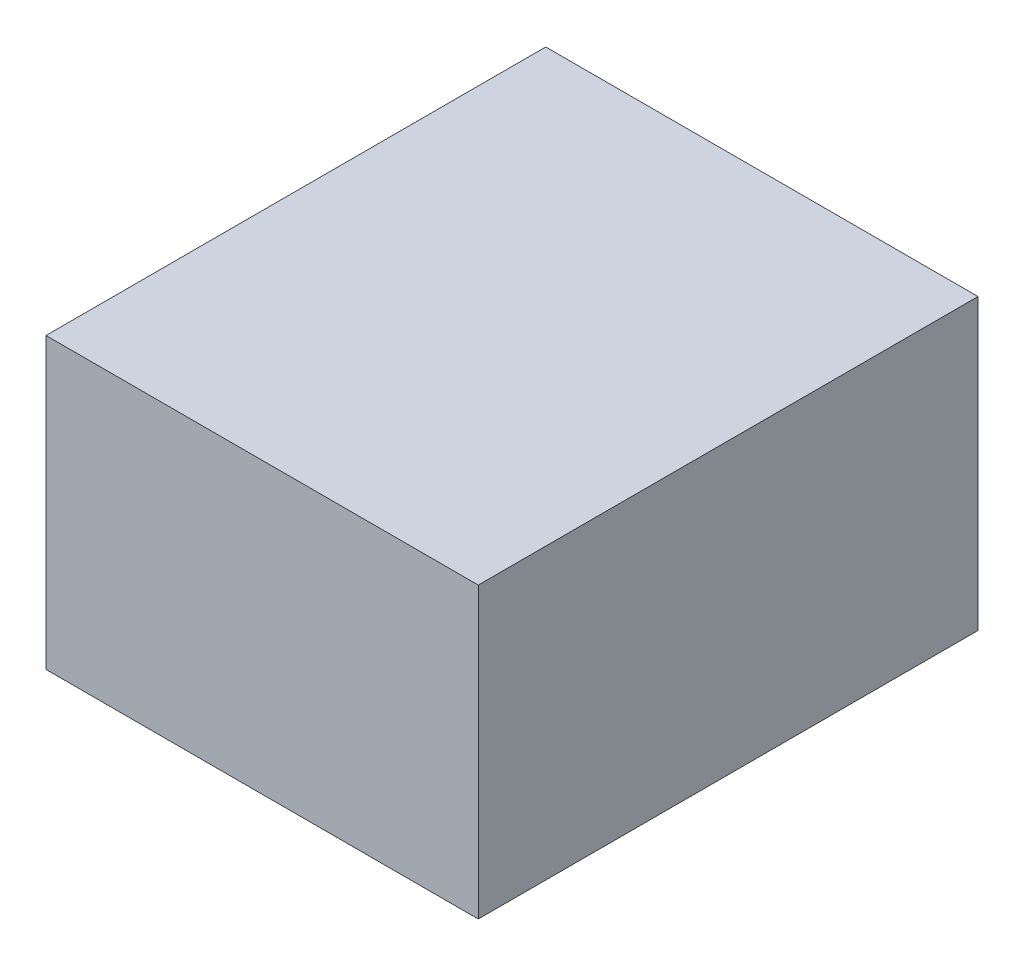
ISO-10303-21;
HEADER;
FILE_DESCRIPTION(('STEP AP214'),'2;1');
FILE_NAME('part.step','',(''),(''),'','','');
FILE_SCHEMA(('AUTOMOTIVE_DESIGN { 1 0 10303 214 1 1 1 1 }'));
ENDSEC;
DATA;
#1=APPLICATION_CONTEXT('core data for automotive mechanical design processes');
#2=APPLICATION_PROTOCOL_DEFINITION('international standard','automotive_design',2000,#1);
#3=PRODUCT_CONTEXT('',#1,'mechanical');
#4=PRODUCT('Part','Part','',(#3));
#5=PRODUCT_RELATED_PRODUCT_CATEGORY('part','',(#4));
#6=PRODUCT_DEFINITION_FORMATION('','',#4);
#7=PRODUCT_DEFINITION_CONTEXT('part definition',#1,'design');
#8=PRODUCT_DEFINITION('design','',#6,#7);
#9=PRODUCT_DEFINITION_SHAPE('','',#8);
#10=(LENGTH_UNIT() NAMED_UNIT(*) SI_UNIT(.MILLI.,.METRE.));
#11=(NAMED_UNIT(*) PLANE_ANGLE_UNIT() SI_UNIT($,.RADIAN.));
#12=(NAMED_UNIT(*) SI_UNIT($,.STERADIAN.) SOLID_ANGLE_UNIT());
#13=UNCERTAINTY_MEASURE_WITH_UNIT(LENGTH_MEASURE(1.E-05),#10,'distance_accuracy_value','');
#14=(GEOMETRIC_REPRESENTATION_CONTEXT(3) GLOBAL_UNCERTAINTY_ASSIGNED_CONTEXT((#13)) GLOBAL_UNIT_ASSIGNED_CONTEXT((#10,
#11,#12)) REPRESENTATION_CONTEXT('',''));
#15=CARTESIAN_POINT('',(0.,0.,0.));
#16=DIRECTION('',(0.,0.,1.));
#17=DIRECTION('',(1.,0.,0.));
#18=AXIS2_PLACEMENT_3D('',#15,#16,#17);
#19=CARTESIAN_POINT('',(0.,0.,101.6));
#20=CARTESIAN_POINT('',(-0.161456166213855,-8.80682857893025,90.3900110978467));
#21=CARTESIAN_POINT('',(-24.5375363297914,47.4863543889421,82.5227913092164));
#22=CARTESIAN_POINT('',(-9.21380364995567,0.0610764653543384,44.1387854031464));
#23=CARTESIAN_POINT('',(18.7958772758672,14.026660670037,31.12334443118));
#24=CARTESIAN_POINT('',(36.9374847479725,20.4231066463661,25.4));
#25=CARTESIAN_POINT('',(0.,0.,101.6));
#26=CARTESIAN_POINT('',(-2.70965146499869,-7.33544956058059,90.3981227477073));
#27=CARTESIAN_POINT('',(-6.43754095514007,44.9919741604561,82.520875414313));
#28=CARTESIAN_POINT('',(-8.55238277983755,7.81973446501629,44.1373151611525));
#29=CARTESIAN_POINT('',(19.853323250958,6.52086740262849,31.1314560810406));
#30=CARTESIAN_POINT('',(36.9374847479725,6.80770221545535,25.4));
#31=CARTESIAN_POINT('',(0.,0.,101.6));
#32=CARTESIAN_POINT('',(-5.25784676378353,-5.86407054223094,90.4062343975679));
#33=CARTESIAN_POINT('',(10.9262983284026,44.1888945435245,82.5189595194096));
#34=CARTESIAN_POINT('',(-5.64701474105575,10.4229787358583,44.1358449191586));
#35=CARTESIAN_POINT('',(20.9107692260488,-0.984925864780037,31.1395677309013));
#36=CARTESIAN_POINT('',(36.9374847479725,-6.80770221545535,25.4));
#37=CARTESIAN_POINT('',(0.,0.,101.6));
#38=CARTESIAN_POINT('',(-7.80604206256838,-4.39269152388128,90.4143460474285));
#39=CARTESIAN_POINT('',(28.931646273169,45.1152339581451,82.5170436245062));
#40=CARTESIAN_POINT('',(-4.69709006736013,7.75461690827075,44.1343746771647));
#41=CARTESIAN_POINT('',(21.9682152011396,-8.49071913218856,31.1476793807619));
#42=CARTESIAN_POINT('',(36.9374847479725,-20.4231066463661,25.4));
#43=B_SPLINE_SURFACE_WITH_KNOTS('',3,3,((#19,#20,#21,#22,#23,#24),(#25,#26,#27,#28,#29,#30),
(#31,#32,#33,#34,#35,#36),(#37,#38,#39,#40,#41,#42)),.UNSPECIFIED.,.F.,.F.,.F.,(4,4),(4,1,1,4),
(0.,1.),(0.,0.352431840203021,0.614756103061783,1.),.UNSPECIFIED.);
#44=CARTESIAN_POINT('',(0.,0.,101.6));
#45=CARTESIAN_POINT('',(-7.80604206256838,-4.39269152388128,90.4143460474285));
#46=CARTESIAN_POINT('',(28.931646273169,45.1152339581451,82.5170436245062));
#47=CARTESIAN_POINT('',(-4.69709006736013,7.75461690827075,44.1343746771647));
#48=CARTESIAN_POINT('',(21.9682152011396,-8.49071913218856,31.1476793807619));
#49=CARTESIAN_POINT('',(36.9374847479725,-20.4231066463661,25.4));
#50=B_SPLINE_CURVE_WITH_KNOTS('',3,(#44,#45,#46,#47,#48,#49),.UNSPECIFIED.,.F.,.F.,(4,1,1,4),
(0.,0.352431840203021,0.614756103061783,1.),.UNSPECIFIED.);
#51=CARTESIAN_POINT('',(0.,0.,101.6));
#52=VERTEX_POINT('',#51);
#53=CARTESIAN_POINT('',(36.9374847479725,-20.4231066463661,25.4));
#54=VERTEX_POINT('',#53);
#55=EDGE_CURVE('E243',#52,#54,#50,.T.);
#56=CARTESIAN_POINT('',(0.,0.,101.6));
#57=CARTESIAN_POINT('',(-0.161456166213855,-8.80682857893025,90.3900110978467));
#58=CARTESIAN_POINT('',(-24.5375363297914,47.4863543889421,82.5227913092164));
#59=CARTESIAN_POINT('',(-9.21380364995567,0.0610764653543384,44.1387854031464));
#60=CARTESIAN_POINT('',(18.7958772758672,14.026660670037,31.12334443118));
#61=CARTESIAN_POINT('',(36.9374847479725,20.4231066463661,25.4));
#62=B_SPLINE_CURVE_WITH_KNOTS('',3,(#56,#57,#58,#59,#60,#61),.UNSPECIFIED.,.F.,.F.,(4,1,1,4),
(0.,0.352431840203021,0.614756103061783,1.),.UNSPECIFIED.);
#63=CARTESIAN_POINT('',(36.9374847479725,20.4231066463661,25.4));
#64=VERTEX_POINT('',#63);
#65=EDGE_CURVE('E239',#64,#52,#62,.F.);
#66=DIRECTION('',(0.,1.,0.));
#67=VECTOR('',#66,1.);
#68=CARTESIAN_POINT('',(36.9374847479725,20.4231066463661,25.4));
#69=LINE('',#68,#67);
#70=EDGE_CURVE('E208',#54,#64,#69,.T.);
#71=ORIENTED_EDGE('',*,*,#55,.F.);
#72=ORIENTED_EDGE('',*,*,#65,.F.);
#73=ORIENTED_EDGE('',*,*,#70,.F.);
#74=EDGE_LOOP('',(#71,#72,#73));
#75=FACE_BOUND('',#74,.T.);
#76=ADVANCED_FACE('F60',(#75),#43,.F.);
#77=CARTESIAN_POINT('',(0.,0.,101.6));
#78=CARTESIAN_POINT('',(-7.80604206256837,-4.39269152388128,90.4143460474286));
#79=CARTESIAN_POINT('',(28.931646273169,45.1152339581451,82.5170436245062));
#80=CARTESIAN_POINT('',(-4.69709006736013,7.75461690827075,44.1343746771647));
#81=CARTESIAN_POINT('',(21.9682152011396,-8.49071913218856,31.1476793807619));
#82=CARTESIAN_POINT('',(36.9374847479725,-20.4231066463661,25.4));
#83=CARTESIAN_POINT('',(0.,0.,101.6));
#84=CARTESIAN_POINT('',(-7.33597684576478,-1.96065700709015,91.0524749707828));
#85=CARTESIAN_POINT('',(35.6752656867836,28.7732225050233,82.3663236140291));
#86=CARTESIAN_POINT('',(2.37491880085313,9.75249744423343,44.018713380539));
#87=CARTESIAN_POINT('',(16.1191692705829,-9.13137955474962,31.7858083041161));
#88=CARTESIAN_POINT('',(24.6249898319817,-20.4231066463661,25.4));
#89=CARTESIAN_POINT('',(0.,0.,101.6));
#90=CARTESIAN_POINT('',(-6.86591162896119,0.471377509700983,91.690603894137));
#91=CARTESIAN_POINT('',(43.515516349886,13.9143912337294,82.215603603552));
#92=CARTESIAN_POINT('',(6.10418199722109,7.22935586297321,43.9030520839134));
#93=CARTESIAN_POINT('',(10.2701233400261,-9.77203997731067,32.4239372274703));
#94=CARTESIAN_POINT('',(12.3124949159908,-20.4231066463661,25.4));
#95=CARTESIAN_POINT('',(0.,0.,101.6));
#96=CARTESIAN_POINT('',(-6.39584641215759,2.90341202649212,92.3287328174912));
#97=CARTESIAN_POINT('',(53.1742421587129,-0.63529331915581,82.064883593075));
#98=CARTESIAN_POINT('',(4.29037871106099,3.76387486232459,43.7873907872877));
#99=CARTESIAN_POINT('',(4.42107740946935,-10.4127003998717,33.0620661508246));
#100=CARTESIAN_POINT('',(0.,-20.4231066463661,25.4));
#101=B_SPLINE_SURFACE_WITH_KNOTS('',3,3,((#77,#78,#79,#80,#81,#82),(#83,#84,#85,#86,#87,#88),
(#89,#90,#91,#92,#93,#94),(#95,#96,#97,#98,#99,#100)),.UNSPECIFIED.,.F.,.F.,.F.,(4,4),(4,1,1,4),
(0.,1.),(0.,0.352431840203021,0.614756103061783,1.),.UNSPECIFIED.);
#102=CARTESIAN_POINT('',(0.,0.,101.6));
#103=CARTESIAN_POINT('',(-6.39584641215759,2.90341202649212,92.3287328174912));
#104=CARTESIAN_POINT('',(53.1742421587129,-0.63529331915581,82.064883593075));
#105=CARTESIAN_POINT('',(4.29037871106099,3.76387486232459,43.7873907872877));
#106=CARTESIAN_POINT('',(4.42107740946935,-10.4127003998717,33.0620661508246));
#107=CARTESIAN_POINT('',(0.,-20.4231066463661,25.4));
#108=B_SPLINE_CURVE_WITH_KNOTS('',3,(#102,#103,#104,#105,#106,#107),.UNSPECIFIED.,.F.,.F.,(4,1,
1,4),(0.,0.352431840203021,0.614756103061783,1.),.UNSPECIFIED.);
#109=CARTESIAN_POINT('',(0.,-20.4231066463661,25.4));
#110=VERTEX_POINT('',#109);
#111=EDGE_CURVE('E234',#52,#110,#108,.T.);
#112=DIRECTION('',(1.,0.,0.));
#113=VECTOR('',#112,1.);
#114=CARTESIAN_POINT('',(-36.9374847479725,-20.4231066463661,25.4));
#115=LINE('',#114,#113);
#116=EDGE_CURVE('E167',#110,#54,#115,.T.);
#117=ORIENTED_EDGE('',*,*,#111,.F.);
#118=ORIENTED_EDGE('',*,*,#55,.T.);
#119=ORIENTED_EDGE('',*,*,#116,.F.);
#120=EDGE_LOOP('',(#117,#118,#119));
#121=FACE_BOUND('',#120,.T.);
#122=ADVANCED_FACE('F242',(#121),#101,.F.);
#123=CARTESIAN_POINT('',(0.,0.,101.6));
#124=CARTESIAN_POINT('',(11.8896312646873,-2.53548717088972,91.4521042416582));
#125=CARTESIAN_POINT('',(-56.9659134477832,0.548392951437509,82.2719349635716));
#126=CARTESIAN_POINT('',(2.31634527119978,-3.83056148990464,43.9462803063632));
#127=CARTESIAN_POINT('',(-23.5522823889213,10.7806252554741,32.1854375749916));
#128=CARTESIAN_POINT('',(-36.9374847479725,20.4231066463661,25.4));
#129=CARTESIAN_POINT('',(0.,0.,101.6));
#130=CARTESIAN_POINT('',(7.87260212105361,-4.62593430690323,91.098073193721));
#131=CARTESIAN_POINT('',(-44.542274019888,15.5822090397403,82.3555537454532));
#132=CARTESIAN_POINT('',(-6.44737396867199,-0.667332204073219,44.0104486719576));
#133=CARTESIAN_POINT('',(-9.43622916732512,11.8626370603284,31.8314065270544));
#134=CARTESIAN_POINT('',(-12.3124949159908,20.4231066463661,25.4));
#135=CARTESIAN_POINT('',(0.,0.,101.6));
#136=CARTESIAN_POINT('',(3.85557297741988,-6.71638144291674,90.7440421457839));
#137=CARTESIAN_POINT('',(-33.9514219325894,30.8241455577693,82.4391725273348));
#138=CARTESIAN_POINT('',(-9.62440036803476,1.86150547016113,44.074617037552));
#139=CARTESIAN_POINT('',(4.67982405427105,12.9446488651827,31.4773754791172));
#140=CARTESIAN_POINT('',(12.3124949159908,20.4231066463661,25.4));
#141=CARTESIAN_POINT('',(0.,0.,101.6));
#142=CARTESIAN_POINT('',(-0.161456166213854,-8.80682857893025,90.3900110978467));
#143=CARTESIAN_POINT('',(-24.5375363297914,47.4863543889421,82.5227913092164));
#144=CARTESIAN_POINT('',(-9.21380364995567,0.0610764653543351,44.1387854031464));
#145=CARTESIAN_POINT('',(18.7958772758672,14.026660670037,31.12334443118));
#146=CARTESIAN_POINT('',(36.9374847479725,20.4231066463661,25.4));
#147=B_SPLINE_SURFACE_WITH_KNOTS('',3,3,((#123,#124,#125,#126,#127,#128),(#129,#130,#131,#132,
#133,#134),(#135,#136,#137,#138,#139,#140),(#141,#142,#143,#144,#145,#146)),.UNSPECIFIED.,.F.,
.F.,.F.,(4,4),(4,1,1,4),(0.,1.),(0.,0.352431840203021,0.614756103061783,1.),.UNSPECIFIED.);
#148=CARTESIAN_POINT('',(0.,0.,101.6));
#149=CARTESIAN_POINT('',(11.8896312646873,-2.53548717088971,91.4521042416582));
#150=CARTESIAN_POINT('',(-56.9659134477831,0.548392951437499,82.2719349635716));
#151=CARTESIAN_POINT('',(2.31634527119978,-3.83056148990463,43.9462803063633));
#152=CARTESIAN_POINT('',(-23.5522823889213,10.7806252554741,32.1854375749916));
#153=CARTESIAN_POINT('',(-36.9374847479725,20.4231066463661,25.4));
#154=B_SPLINE_CURVE_WITH_KNOTS('',3,(#148,#149,#150,#151,#152,#153),.UNSPECIFIED.,.F.,.F.,(4,1,
1,4),(0.,0.352431840203021,0.614756103061783,1.),.UNSPECIFIED.);
#155=CARTESIAN_POINT('',(-36.9374847479725,20.4231066463661,25.4));
#156=VERTEX_POINT('',#155);
#157=EDGE_CURVE('E187',#52,#156,#154,.T.);
#158=DIRECTION('',(-1.,0.,0.));
#159=VECTOR('',#158,1.);
#160=CARTESIAN_POINT('',(-36.9374847479725,20.4231066463661,25.4));
#161=LINE('',#160,#159);
#162=EDGE_CURVE('E181',#64,#156,#161,.T.);
#163=ORIENTED_EDGE('',*,*,#65,.T.);
#164=ORIENTED_EDGE('',*,*,#157,.T.);
#165=ORIENTED_EDGE('',*,*,#162,.F.);
#166=EDGE_LOOP('',(#163,#164,#165));
#167=FACE_BOUND('',#166,.T.);
#168=ADVANCED_FACE('F266',(#167),#147,.F.);
#169=CARTESIAN_POINT('',(0.,0.,101.6));
#170=CARTESIAN_POINT('',(-6.39584641215759,2.90341202649211,92.3287328174913));
#171=CARTESIAN_POINT('',(53.1742421587129,-0.635293319155802,82.064883593075));
#172=CARTESIAN_POINT('',(4.29037871106099,3.76387486232457,43.7873907872877));
#173=CARTESIAN_POINT('',(4.42107740946935,-10.4127003998717,33.0620661508246));
#174=CARTESIAN_POINT('',(0.,-20.4231066463661,25.4));
#175=CARTESIAN_POINT('',(0.,0.,101.6));
#176=CARTESIAN_POINT('',(-4.21007888603378,4.87121754397149,91.6824922442764));
#177=CARTESIAN_POINT('',(42.0144931605079,-15.6401426182191,82.2175194984555));
#178=CARTESIAN_POINT('',(10.8518566235125,0.622874452353174,43.9045223259073));
#179=CARTESIAN_POINT('',(-3.31790748564284,-11.6173538232602,32.4158255776097));
#180=CARTESIAN_POINT('',(-12.3124949159909,-20.4231066463661,25.4));
#181=CARTESIAN_POINT('',(0.,0.,101.6));
#182=CARTESIAN_POINT('',(-2.02431135990997,6.83902306145087,91.0362516710615));
#183=CARTESIAN_POINT('',(32.6875315028993,-30.8531123470088,82.3701554038359));
#184=CARTESIAN_POINT('',(11.826641695455,-1.88373434602116,44.0216538645269));
#185=CARTESIAN_POINT('',(-11.056892380755,-12.8220072466486,31.7695850043949));
#186=CARTESIAN_POINT('',(-24.6249898319817,-20.4231066463661,25.4));
#187=CARTESIAN_POINT('',(0.,0.,101.6));
#188=CARTESIAN_POINT('',(0.161456166213842,8.80682857893025,90.3900110978467));
#189=CARTESIAN_POINT('',(24.5375363297915,-47.4863543889421,82.5227913092164));
#190=CARTESIAN_POINT('',(9.21380364995565,-0.0610764653543416,44.1387854031464));
#191=CARTESIAN_POINT('',(-18.7958772758672,-14.026660670037,31.12334443118));
#192=CARTESIAN_POINT('',(-36.9374847479725,-20.4231066463661,25.4));
#193=B_SPLINE_SURFACE_WITH_KNOTS('',3,3,((#169,#170,#171,#172,#173,#174),(#175,#176,#177,#178,
#179,#180),(#181,#182,#183,#184,#185,#186),(#187,#188,#189,#190,#191,#192)),.UNSPECIFIED.,.F.,
.F.,.F.,(4,4),(4,1,1,4),(0.,1.),(0.,0.352431840203021,0.614756103061783,1.),.UNSPECIFIED.);
#194=CARTESIAN_POINT('',(0.,0.,101.6));
#195=CARTESIAN_POINT('',(0.161456166213842,8.80682857893025,90.3900110978467));
#196=CARTESIAN_POINT('',(24.5375363297915,-47.4863543889421,82.5227913092164));
#197=CARTESIAN_POINT('',(9.21380364995565,-0.0610764653543416,44.1387854031464));
#198=CARTESIAN_POINT('',(-18.7958772758672,-14.026660670037,31.12334443118));
#199=CARTESIAN_POINT('',(-36.9374847479725,-20.4231066463661,25.4));
#200=B_SPLINE_CURVE_WITH_KNOTS('',3,(#194,#195,#196,#197,#198,#199),.UNSPECIFIED.,.F.,.F.,(4,1,
1,4),(0.,0.352431840203021,0.614756103061783,1.),.UNSPECIFIED.);
#201=CARTESIAN_POINT('',(-36.9374847479725,-20.4231066463661,25.4));
#202=VERTEX_POINT('',#201);
#203=EDGE_CURVE('E236',#52,#202,#200,.T.);
#204=EDGE_CURVE('E64',#202,#110,#115,.T.);
#205=ORIENTED_EDGE('',*,*,#203,.F.);
#206=ORIENTED_EDGE('',*,*,#111,.T.);
#207=ORIENTED_EDGE('',*,*,#204,.F.);
#208=EDGE_LOOP('',(#205,#206,#207));
#209=FACE_BOUND('',#208,.T.);
#210=ADVANCED_FACE('F235',(#209),#193,.F.);
#211=CARTESIAN_POINT('',(0.,0.,101.6));
#212=CARTESIAN_POINT('',(0.161456166213841,8.80682857893025,90.3900110978467));
#213=CARTESIAN_POINT('',(24.5375363297915,-47.4863543889421,82.5227913092164));
#214=CARTESIAN_POINT('',(9.21380364995565,-0.0610764653543408,44.1387854031464));
#215=CARTESIAN_POINT('',(-18.7958772758672,-14.026660670037,31.12334443118));
#216=CARTESIAN_POINT('',(-36.9374847479725,-20.4231066463661,25.4));
#217=CARTESIAN_POINT('',(0.,0.,101.6));
#218=CARTESIAN_POINT('',(2.85393975913663,7.91398769187971,90.7392094695939));
#219=CARTESIAN_POINT('',(6.40346142605392,-45.5882887773523,82.4403139596996));
#220=CARTESIAN_POINT('',(8.52623042946266,-6.52343305440252,44.0754929633624));
#221=CARTESIAN_POINT('',(-19.7090349568201,-10.4807974149663,31.4725428029273));
#222=CARTESIAN_POINT('',(-36.9374847479725,-13.6154044309107,25.4));
#223=CARTESIAN_POINT('',(0.,0.,101.6));
#224=CARTESIAN_POINT('',(5.54642335205943,7.02114680482917,91.0884078413412));
#225=CARTESIAN_POINT('',(-10.9944573865749,-45.3815237773168,82.3578366101827));
#226=CARTESIAN_POINT('',(5.59471004030598,-7.83037591463072,44.0122005235784));
#227=CARTESIAN_POINT('',(-20.6221926377729,-6.93493415989553,31.8217411746745));
#228=CARTESIAN_POINT('',(-36.9374847479725,-6.80770221545535,25.4));
#229=CARTESIAN_POINT('',(0.,0.,101.6));
#230=CARTESIAN_POINT('',(8.23890694498222,6.12830591777863,91.4376062130884));
#231=CARTESIAN_POINT('',(-29.0338848604276,-46.9041778088335,82.2753592606658));
#232=CARTESIAN_POINT('',(4.6186330162355,-3.86571267642938,43.9489080837943));
#233=CARTESIAN_POINT('',(-21.5353503187258,-3.38907090482479,32.1709395464218));
#234=CARTESIAN_POINT('',(-36.9374847479725,0.,25.4));
#235=B_SPLINE_SURFACE_WITH_KNOTS('',3,3,((#211,#212,#213,#214,#215,#216),(#217,#218,#219,#220,
#221,#222),(#223,#224,#225,#226,#227,#228),(#229,#230,#231,#232,#233,#234)),.UNSPECIFIED.,.F.,
.F.,.F.,(4,4),(4,1,1,4),(0.,1.),(0.,0.352431840203021,0.614756103061783,1.),.UNSPECIFIED.);
#236=CARTESIAN_POINT('',(0.,0.,101.6));
#237=CARTESIAN_POINT('',(8.23890694498222,6.12830591777863,91.4376062130884));
#238=CARTESIAN_POINT('',(-29.0338848604276,-46.9041778088335,82.2753592606658));
#239=CARTESIAN_POINT('',(4.6186330162355,-3.86571267642938,43.9489080837943));
#240=CARTESIAN_POINT('',(-21.5353503187258,-3.38907090482479,32.1709395464218));
#241=CARTESIAN_POINT('',(-36.9374847479725,0.,25.4));
#242=B_SPLINE_CURVE_WITH_KNOTS('',3,(#236,#237,#238,#239,#240,#241),.UNSPECIFIED.,.F.,.F.,(4,1,
1,4),(0.,0.352431840203021,0.614756103061783,1.),.UNSPECIFIED.);
#243=CARTESIAN_POINT('',(-36.9374847479725,0.,25.4));
#244=VERTEX_POINT('',#243);
#245=EDGE_CURVE('E310',#52,#244,#242,.T.);
#246=DIRECTION('',(0.,-1.,0.));
#247=VECTOR('',#246,1.);
#248=CARTESIAN_POINT('',(-36.9374847479725,20.4231066463661,25.4));
#249=LINE('',#248,#247);
#250=EDGE_CURVE('E220',#244,#202,#249,.T.);
#251=ORIENTED_EDGE('',*,*,#245,.F.);
#252=ORIENTED_EDGE('',*,*,#203,.T.);
#253=ORIENTED_EDGE('',*,*,#250,.F.);
#254=EDGE_LOOP('',(#251,#252,#253));
#255=FACE_BOUND('',#254,.T.);
#256=ADVANCED_FACE('F379',(#255),#235,.F.);
#257=CARTESIAN_POINT('',(0.,0.,101.6));
#258=CARTESIAN_POINT('',(8.23890694498222,6.12830591777863,91.4376062130884));
#259=CARTESIAN_POINT('',(-29.0338848604276,-46.9041778088335,82.2753592606658));
#260=CARTESIAN_POINT('',(4.6186330162355,-3.86571267642938,43.9489080837943));
#261=CARTESIAN_POINT('',(-21.5353503187258,-3.38907090482479,32.1709395464218));
#262=CARTESIAN_POINT('',(-36.9374847479725,0.,25.4));
#263=CARTESIAN_POINT('',(0.,0.,101.6));
#264=CARTESIAN_POINT('',(9.4558150515506,3.24037488822251,91.4424388892784));
#265=CARTESIAN_POINT('',(-37.0073151746461,-29.994818528055,82.274217828301));
#266=CARTESIAN_POINT('',(-0.224982174182627,-7.18212349886586,43.948032157984));
#267=CARTESIAN_POINT('',(-22.207661008791,1.33416114860818,32.1757722226117));
#268=CARTESIAN_POINT('',(-36.9374847479725,6.80770221545535,25.4));
#269=CARTESIAN_POINT('',(0.,0.,101.6));
#270=CARTESIAN_POINT('',(10.672723158119,0.3524438586664,91.4472715654683));
#271=CARTESIAN_POINT('',(-46.0773767383524,-14.5686394291045,82.2730763959363));
#272=CARTESIAN_POINT('',(-1.72585169275545,-5.97751220407944,43.9471562321736));
#273=CARTESIAN_POINT('',(-22.8799716988561,6.05739320204115,32.1806048988016));
#274=CARTESIAN_POINT('',(-36.9374847479725,13.6154044309107,25.4));
#275=CARTESIAN_POINT('',(0.,0.,101.6));
#276=CARTESIAN_POINT('',(11.8896312646873,-2.53548717088971,91.4521042416582));
#277=CARTESIAN_POINT('',(-56.9659134477831,0.548392951437499,82.2719349635716));
#278=CARTESIAN_POINT('',(2.31634527119978,-3.83056148990463,43.9462803063633));
#279=CARTESIAN_POINT('',(-23.5522823889213,10.7806252554741,32.1854375749916));
#280=CARTESIAN_POINT('',(-36.9374847479725,20.4231066463661,25.4));
#281=B_SPLINE_SURFACE_WITH_KNOTS('',3,3,((#257,#258,#259,#260,#261,#262),(#263,#264,#265,#266,
#267,#268),(#269,#270,#271,#272,#273,#274),(#275,#276,#277,#278,#279,#280)),.UNSPECIFIED.,.F.,
.F.,.F.,(4,4),(4,1,1,4),(0.,1.),(0.,0.352431840203021,0.614756103061783,1.),.UNSPECIFIED.);
#282=EDGE_CURVE('E219',#156,#244,#249,.T.);
#283=ORIENTED_EDGE('',*,*,#157,.F.);
#284=ORIENTED_EDGE('',*,*,#245,.T.);
#285=ORIENTED_EDGE('',*,*,#282,.F.);
#286=EDGE_LOOP('',(#283,#284,#285));
#287=FACE_BOUND('',#286,.T.);
#288=ADVANCED_FACE('F368',(#287),#281,.F.);
#289=CARTESIAN_POINT('',(10.1786858673828,-14.778668903604,0.));
#290=CARTESIAN_POINT('',(36.9374847479725,-20.4231066463661,25.4));
#291=CARTESIAN_POINT('',(11.3490276022134,-11.4632831403297,0.));
#292=CARTESIAN_POINT('',(36.9374847479725,-13.6154044309107,25.4));
#293=CARTESIAN_POINT('',(12.519369337044,-8.14789737705549,0.));
#294=CARTESIAN_POINT('',(36.9374847479725,-6.80770221545535,25.4));
#295=CARTESIAN_POINT('',(14.8600528067052,-1.51712585050698,0.));
#296=CARTESIAN_POINT('',(36.9374847479725,6.80770221545535,25.4));
#297=CARTESIAN_POINT('',(16.0303945415359,1.79825991276729,0.));
#298=CARTESIAN_POINT('',(36.9374847479725,13.6154044309107,25.4));
#299=CARTESIAN_POINT('',(17.2007362763665,5.11364567604157,0.));
#300=CARTESIAN_POINT('',(36.9374847479725,20.4231066463661,25.4));
#301=B_SPLINE_SURFACE_WITH_KNOTS('',3,1,((#289,#290),(#291,#292),(#293,#294),(#295,#296),(#297,
#298),(#299,#300)),.UNSPECIFIED.,.F.,.F.,.F.,(4,2,4),(2,2),(0.,0.5,1.),(0.,1.),.UNSPECIFIED.);
#302=DIRECTION('',(0.332872112828055,0.942971980761564,0.));
#303=VECTOR('',#302,1.);
#304=CARTESIAN_POINT('',(10.1786858673828,-14.778668903604,0.));
#305=LINE('',#304,#303);
#306=CARTESIAN_POINT('',(10.1786858673828,-14.778668903604,0.));
#307=VERTEX_POINT('',#306);
#308=CARTESIAN_POINT('',(17.2007362763665,5.11364567604157,0.));
#309=VERTEX_POINT('',#308);
#310=EDGE_CURVE('E151',#307,#309,#305,.T.);
#311=DIRECTION('',(-0.716939974802444,0.151229622492705,-0.680534109219357));
#312=VECTOR('',#311,1.);
#313=CARTESIAN_POINT('',(23.5580853076777,-17.600887774985,12.7));
#314=LINE('',#313,#312);
#315=EDGE_CURVE('E155',#54,#307,#314,.T.);
#316=DIRECTION('',(0.554027479081156,0.429749716863571,0.712999812958363));
#317=VECTOR('',#316,1.);
#318=CARTESIAN_POINT('',(27.0691105121695,12.7683761612038,12.7));
#319=LINE('',#318,#317);
#320=EDGE_CURVE('E157',#309,#64,#319,.T.);
#321=ORIENTED_EDGE('',*,*,#310,.F.);
#322=ORIENTED_EDGE('',*,*,#315,.F.);
#323=ORIENTED_EDGE('',*,*,#70,.T.);
#324=ORIENTED_EDGE('',*,*,#320,.F.);
#325=EDGE_LOOP('',(#321,#322,#323,#324));
#326=FACE_BOUND('',#325,.T.);
#327=ADVANCED_FACE('F153',(#326),#301,.F.);
#328=CARTESIAN_POINT('',(17.2007362763665,5.11364567604157,0.));
#329=CARTESIAN_POINT('',(36.9374847479725,20.4231066463661,25.4));
#330=CARTESIAN_POINT('',(14.4092725274613,7.25121735300491,0.));
#331=CARTESIAN_POINT('',(24.6249898319817,20.4231066463661,25.4));
#332=CARTESIAN_POINT('',(11.617808778556,9.38878902996825,0.));
#333=CARTESIAN_POINT('',(12.3124949159908,20.4231066463661,25.4));
#334=CARTESIAN_POINT('',(6.03488128074552,13.6639323838949,0.));
#335=CARTESIAN_POINT('',(-12.3124949159909,20.4231066463661,25.4));
#336=CARTESIAN_POINT('',(3.24341753184028,15.8015040608583,0.));
#337=CARTESIAN_POINT('',(-24.6249898319817,20.4231066463661,25.4));
#338=CARTESIAN_POINT('',(0.451953782935031,17.9390757378216,0.));
#339=CARTESIAN_POINT('',(-36.9374847479725,20.4231066463661,25.4));
#340=B_SPLINE_SURFACE_WITH_KNOTS('',3,1,((#328,#329),(#330,#331),(#332,#333),(#334,#335),(#336,
#337),(#338,#339)),.UNSPECIFIED.,.F.,.F.,.F.,(4,2,4),(2,2),(0.,0.5,1.),(0.,1.),.UNSPECIFIED.);
#341=DIRECTION('',(-0.793956507169669,0.607974559272786,0.));
#342=VECTOR('',#341,1.);
#343=CARTESIAN_POINT('',(17.2007362763665,5.11364567604157,0.));
#344=LINE('',#343,#342);
#345=CARTESIAN_POINT('',(0.451953782935031,17.9390757378216,0.));
#346=VERTEX_POINT('',#345);
#347=EDGE_CURVE('E161',#309,#346,#344,.T.);
#348=DIRECTION('',(-0.825935471205216,0.0548724270689704,0.561087884517727));
#349=VECTOR('',#348,1.);
#350=CARTESIAN_POINT('',(-18.2427654825188,19.1810911920938,12.7));
#351=LINE('',#350,#349);
#352=EDGE_CURVE('E169',#346,#156,#351,.T.);
#353=ORIENTED_EDGE('',*,*,#347,.F.);
#354=ORIENTED_EDGE('',*,*,#320,.T.);
#355=ORIENTED_EDGE('',*,*,#162,.T.);
#356=ORIENTED_EDGE('',*,*,#352,.F.);
#357=EDGE_LOOP('',(#353,#354,#355,#356));
#358=FACE_BOUND('',#357,.T.);
#359=ADVANCED_FACE('F417',(#358),#340,.F.);
#360=CARTESIAN_POINT('',(-10.9099624495157,-14.24736536695,0.));
#361=CARTESIAN_POINT('',(-36.9374847479725,-20.4231066463661,25.4));
#362=CARTESIAN_POINT('',(-7.39518773003262,-14.3359159563923,0.));
#363=CARTESIAN_POINT('',(-24.6249898319817,-20.4231066463661,25.4));
#364=CARTESIAN_POINT('',(-3.88041301054951,-14.4244665458346,0.));
#365=CARTESIAN_POINT('',(-12.3124949159908,-20.4231066463661,25.4));
#366=CARTESIAN_POINT('',(3.14913642841666,-14.6015677247193,0.));
#367=CARTESIAN_POINT('',(12.3124949159909,-20.4231066463661,25.4));
#368=CARTESIAN_POINT('',(6.66391114789973,-14.6901183141616,0.));
#369=CARTESIAN_POINT('',(24.6249898319817,-20.4231066463661,25.4));
#370=CARTESIAN_POINT('',(10.1786858673828,-14.778668903604,0.));
#371=CARTESIAN_POINT('',(36.9374847479725,-20.4231066463661,25.4));
#372=B_SPLINE_SURFACE_WITH_KNOTS('',3,1,((#360,#361),(#362,#363),(#364,#365),(#366,#367),(#368,
#369),(#370,#371)),.UNSPECIFIED.,.F.,.F.,.F.,(4,2,4),(2,2),(0.,0.5,1.),(0.,1.),.UNSPECIFIED.);
#373=DIRECTION('',(0.999682786804397,-0.0251858247233279,0.));
#374=VECTOR('',#373,1.);
#375=CARTESIAN_POINT('',(-10.9099624495157,-14.24736536695,0.));
#376=LINE('',#375,#374);
#377=CARTESIAN_POINT('',(-10.9099624495157,-14.24736536695,0.));
#378=VERTEX_POINT('',#377);
#379=EDGE_CURVE('E78',#378,#307,#376,.T.);
#380=DIRECTION('',(-0.705580510876486,-0.167418267363458,0.68856899902936));
#381=VECTOR('',#380,1.);
#382=CARTESIAN_POINT('',(-23.9237235987441,-17.335236006658,12.7));
#383=LINE('',#382,#381);
#384=EDGE_CURVE('E227',#378,#202,#383,.T.);
#385=ORIENTED_EDGE('',*,*,#379,.F.);
#386=ORIENTED_EDGE('',*,*,#384,.T.);
#387=ORIENTED_EDGE('',*,*,#204,.T.);
#388=ORIENTED_EDGE('',*,*,#116,.T.);
#389=ORIENTED_EDGE('',*,*,#315,.T.);
#390=EDGE_LOOP('',(#385,#386,#387,#388,#389));
#391=FACE_BOUND('',#390,.T.);
#392=ADVANCED_FACE('F165',(#391),#372,.F.);
#393=CARTESIAN_POINT('',(0.451953782935031,17.9390757378216,0.));
#394=CARTESIAN_POINT('',(-36.9374847479725,20.4231066463661,25.4));
#395=CARTESIAN_POINT('',(-2.44360742708223,15.9447819242998,0.));
#396=CARTESIAN_POINT('',(-36.9374847479725,17.0192555386384,25.4));
#397=CARTESIAN_POINT('',(-5.33916863709949,13.950488110778,0.));
#398=CARTESIAN_POINT('',(-36.9374847479725,13.6154044309107,25.4));
#399=CARTESIAN_POINT('',(-11.130291057134,9.96190048373439,0.));
#400=CARTESIAN_POINT('',(-36.9374847479725,6.80770221545538,25.4));
#401=CARTESIAN_POINT('',(-14.0258522671513,7.96760667021258,0.));
#402=CARTESIAN_POINT('',(-36.9374847479725,3.4038511077277,25.4));
#403=CARTESIAN_POINT('',(-16.9214134771686,5.97331285669078,0.));
#404=CARTESIAN_POINT('',(-36.9374847479725,0.,25.4));
#405=B_SPLINE_SURFACE_WITH_KNOTS('',3,1,((#393,#394),(#395,#396),(#397,#398),(#399,#400),(#401,
#402),(#403,#404)),.UNSPECIFIED.,.F.,.F.,.F.,(4,2,4),(2,2),(0.,0.5,1.),(0.,1.),.UNSPECIFIED.);
#406=DIRECTION('',(-0.82356421984806,-0.567223038835744,0.));
#407=VECTOR('',#406,1.);
#408=CARTESIAN_POINT('',(0.451953782935031,17.9390757378216,0.));
#409=LINE('',#408,#407);
#410=CARTESIAN_POINT('',(-16.9214134771686,5.97331285669078,0.));
#411=VERTEX_POINT('',#410);
#412=EDGE_CURVE('E188',#346,#411,#409,.T.);
#413=DIRECTION('',(-0.608651749408227,-0.181637408800126,0.772367075726743));
#414=VECTOR('',#413,1.);
#415=CARTESIAN_POINT('',(-26.9294491125705,2.98665642834539,12.7));
#416=LINE('',#415,#414);
#417=EDGE_CURVE('E494',#411,#244,#416,.T.);
#418=ORIENTED_EDGE('',*,*,#412,.F.);
#419=ORIENTED_EDGE('',*,*,#352,.T.);
#420=ORIENTED_EDGE('',*,*,#282,.T.);
#421=ORIENTED_EDGE('',*,*,#417,.F.);
#422=EDGE_LOOP('',(#418,#419,#420,#421));
#423=FACE_BOUND('',#422,.T.);
#424=ADVANCED_FACE('F462',(#423),#405,.F.);
#425=CARTESIAN_POINT('',(-16.9214134771686,5.97331285669078,0.));
#426=CARTESIAN_POINT('',(-36.9374847479725,0.,25.4));
#427=CARTESIAN_POINT('',(-15.9195049725598,2.60319981941732,0.));
#428=CARTESIAN_POINT('',(-36.9374847479725,-3.40385110772767,25.4));
#429=CARTESIAN_POINT('',(-14.917596467951,-0.766913217856144,0.));
#430=CARTESIAN_POINT('',(-36.9374847479725,-6.80770221545534,25.4));
#431=CARTESIAN_POINT('',(-12.9137794587333,-7.50713929240306,0.));
#432=CARTESIAN_POINT('',(-36.9374847479725,-13.6154044309107,25.4));
#433=CARTESIAN_POINT('',(-11.9118709541245,-10.8772523296765,0.));
#434=CARTESIAN_POINT('',(-36.9374847479725,-17.0192555386384,25.4));
#435=CARTESIAN_POINT('',(-10.9099624495157,-14.24736536695,0.));
#436=CARTESIAN_POINT('',(-36.9374847479725,-20.4231066463661,25.4));
#437=B_SPLINE_SURFACE_WITH_KNOTS('',3,1,((#425,#426),(#427,#428),(#429,#430),(#431,#432),(#433,
#434),(#435,#436)),.UNSPECIFIED.,.F.,.F.,.F.,(4,2,4),(2,2),(0.,0.5,1.),(0.,1.),.UNSPECIFIED.);
#438=DIRECTION('',(0.284965827385278,-0.958537676475278,0.));
#439=VECTOR('',#438,1.);
#440=CARTESIAN_POINT('',(-16.9214134771686,5.97331285669078,0.));
#441=LINE('',#440,#439);
#442=EDGE_CURVE('E175',#411,#378,#441,.T.);
#443=ORIENTED_EDGE('',*,*,#442,.F.);
#444=ORIENTED_EDGE('',*,*,#417,.T.);
#445=ORIENTED_EDGE('',*,*,#250,.T.);
#446=ORIENTED_EDGE('',*,*,#384,.F.);
#447=EDGE_LOOP('',(#443,#444,#445,#446));
#448=FACE_BOUND('',#447,.T.);
#449=ADVANCED_FACE('F472',(#448),#437,.F.);
#450=CARTESIAN_POINT('',(-56.792645831694,38.0009615491482,131.318));
#451=DIRECTION('',(1.,0.,0.));
#452=DIRECTION('',(0.,0.,-1.));
#453=AXIS2_PLACEMENT_3D('',#450,#451,#452);
#454=PLANE('',#453);
#455=DIRECTION('',(0.,-1.,0.));
#456=VECTOR('',#455,1.);
#457=CARTESIAN_POINT('',(-56.792645831694,38.0009615491482,0.));
#458=LINE('',#457,#456);
#459=CARTESIAN_POINT('',(-56.792645831694,38.0009615491482,0.));
#460=VERTEX_POINT('',#459);
#461=CARTESIAN_POINT('',(-56.792645831694,-38.0009615491482,0.));
#462=VERTEX_POINT('',#461);
#463=EDGE_CURVE('E617',#460,#462,#458,.T.);
#464=ORIENTED_EDGE('',*,*,#463,.T.);
#465=DIRECTION('',(0.,0.,-1.));
#466=VECTOR('',#465,1.);
#467=CARTESIAN_POINT('',(-56.792645831694,-38.0009615491482,131.318));
#468=LINE('',#467,#466);
#469=CARTESIAN_POINT('',(-56.792645831694,-38.0009615491482,131.318));
#470=VERTEX_POINT('',#469);
#471=EDGE_CURVE('E12',#470,#462,#468,.T.);
#472=ORIENTED_EDGE('',*,*,#471,.F.);
#473=DIRECTION('',(0.,-1.,0.));
#474=VECTOR('',#473,1.);
#475=CARTESIAN_POINT('',(-56.792645831694,38.0009615491482,131.318));
#476=LINE('',#475,#474);
#477=CARTESIAN_POINT('',(-56.792645831694,38.0009615491482,131.318));
#478=VERTEX_POINT('',#477);
#479=EDGE_CURVE('E632',#478,#470,#476,.T.);
#480=ORIENTED_EDGE('',*,*,#479,.F.);
#481=DIRECTION('',(0.,0.,-1.));
#482=VECTOR('',#481,1.);
#483=CARTESIAN_POINT('',(-56.792645831694,38.0009615491482,131.318));
#484=LINE('',#483,#482);
#485=EDGE_CURVE('E87',#478,#460,#484,.T.);
#486=ORIENTED_EDGE('',*,*,#485,.T.);
#487=EDGE_LOOP('',(#464,#472,#480,#486));
#488=FACE_BOUND('',#487,.T.);
#489=ADVANCED_FACE('F62',(#488),#454,.F.);
#490=CARTESIAN_POINT('',(-56.792645831694,-38.0009615491482,131.318));
#491=DIRECTION('',(0.,1.,0.));
#492=DIRECTION('',(0.,0.,1.));
#493=AXIS2_PLACEMENT_3D('',#490,#491,#492);
#494=PLANE('',#493);
#495=DIRECTION('',(1.,0.,0.));
#496=VECTOR('',#495,1.);
#497=CARTESIAN_POINT('',(-56.792645831694,-38.0009615491482,0.));
#498=LINE('',#497,#496);
#499=CARTESIAN_POINT('',(56.792645831694,-38.0009615491482,0.));
#500=VERTEX_POINT('',#499);
#501=EDGE_CURVE('E619',#462,#500,#498,.T.);
#502=ORIENTED_EDGE('',*,*,#501,.T.);
#503=DIRECTION('',(0.,0.,-1.));
#504=VECTOR('',#503,1.);
#505=CARTESIAN_POINT('',(56.792645831694,-38.0009615491482,131.318));
#506=LINE('',#505,#504);
#507=CARTESIAN_POINT('',(56.792645831694,-38.0009615491482,131.318));
#508=VERTEX_POINT('',#507);
#509=EDGE_CURVE('E70',#508,#500,#506,.T.);
#510=ORIENTED_EDGE('',*,*,#509,.F.);
#511=DIRECTION('',(1.,0.,0.));
#512=VECTOR('',#511,1.);
#513=CARTESIAN_POINT('',(-56.792645831694,-38.0009615491482,131.318));
#514=LINE('',#513,#512);
#515=EDGE_CURVE('E113',#470,#508,#514,.T.);
#516=ORIENTED_EDGE('',*,*,#515,.F.);
#517=ORIENTED_EDGE('',*,*,#471,.T.);
#518=EDGE_LOOP('',(#502,#510,#516,#517));
#519=FACE_BOUND('',#518,.T.);
#520=ADVANCED_FACE('F594',(#519),#494,.F.);
#521=CARTESIAN_POINT('',(56.792645831694,38.0009615491482,131.318));
#522=DIRECTION('',(1.,0.,0.));
#523=DIRECTION('',(0.,0.,-1.));
#524=AXIS2_PLACEMENT_3D('',#521,#522,#523);
#525=PLANE('',#524);
#526=DIRECTION('',(0.,-1.,0.));
#527=VECTOR('',#526,1.);
#528=CARTESIAN_POINT('',(56.792645831694,38.0009615491482,0.));
#529=LINE('',#528,#527);
#530=CARTESIAN_POINT('',(56.792645831694,38.0009615491482,0.));
#531=VERTEX_POINT('',#530);
#532=EDGE_CURVE('E622',#531,#500,#529,.T.);
#533=ORIENTED_EDGE('',*,*,#532,.F.);
#534=DIRECTION('',(0.,0.,-1.));
#535=VECTOR('',#534,1.);
#536=CARTESIAN_POINT('',(56.792645831694,38.0009615491482,131.318));
#537=LINE('',#536,#535);
#538=CARTESIAN_POINT('',(56.792645831694,38.0009615491482,131.318));
#539=VERTEX_POINT('',#538);
#540=EDGE_CURVE('E634',#539,#531,#537,.T.);
#541=ORIENTED_EDGE('',*,*,#540,.F.);
#542=DIRECTION('',(0.,-1.,0.));
#543=VECTOR('',#542,1.);
#544=CARTESIAN_POINT('',(56.792645831694,38.0009615491482,131.318));
#545=LINE('',#544,#543);
#546=EDGE_CURVE('E639',#539,#508,#545,.T.);
#547=ORIENTED_EDGE('',*,*,#546,.T.);
#548=ORIENTED_EDGE('',*,*,#509,.T.);
#549=EDGE_LOOP('',(#533,#541,#547,#548));
#550=FACE_BOUND('',#549,.T.);
#551=ADVANCED_FACE('F588',(#550),#525,.T.);
#552=CARTESIAN_POINT('',(-56.792645831694,38.0009615491482,131.318));
#553=DIRECTION('',(0.,1.,0.));
#554=DIRECTION('',(0.,0.,1.));
#555=AXIS2_PLACEMENT_3D('',#552,#553,#554);
#556=PLANE('',#555);
#557=DIRECTION('',(1.,0.,0.));
#558=VECTOR('',#557,1.);
#559=CARTESIAN_POINT('',(-56.792645831694,38.0009615491482,0.));
#560=LINE('',#559,#558);
#561=EDGE_CURVE('E630',#460,#531,#560,.T.);
#562=ORIENTED_EDGE('',*,*,#561,.F.);
#563=ORIENTED_EDGE('',*,*,#485,.F.);
#564=DIRECTION('',(1.,0.,0.));
#565=VECTOR('',#564,1.);
#566=CARTESIAN_POINT('',(-56.792645831694,38.0009615491482,131.318));
#567=LINE('',#566,#565);
#568=EDGE_CURVE('E625',#478,#539,#567,.T.);
#569=ORIENTED_EDGE('',*,*,#568,.T.);
#570=ORIENTED_EDGE('',*,*,#540,.T.);
#571=EDGE_LOOP('',(#562,#563,#569,#570));
#572=FACE_BOUND('',#571,.T.);
#573=ADVANCED_FACE('F389',(#572),#556,.T.);
#574=CARTESIAN_POINT('',(0.,0.,131.318));
#575=DIRECTION('',(0.,0.,1.));
#576=DIRECTION('',(1.,0.,0.));
#577=AXIS2_PLACEMENT_3D('',#574,#575,#576);
#578=PLANE('',#577);
#579=ORIENTED_EDGE('',*,*,#479,.T.);
#580=ORIENTED_EDGE('',*,*,#515,.T.);
#581=ORIENTED_EDGE('',*,*,#546,.F.);
#582=ORIENTED_EDGE('',*,*,#568,.F.);
#583=EDGE_LOOP('',(#579,#580,#581,#582));
#584=FACE_BOUND('',#583,.T.);
#585=ADVANCED_FACE('F382',(#584),#578,.T.);
#586=CARTESIAN_POINT('',(0.,0.,0.));
#587=DIRECTION('',(0.,0.,1.));
#588=DIRECTION('',(1.,0.,0.));
#589=AXIS2_PLACEMENT_3D('',#586,#587,#588);
#590=PLANE('',#589);
#591=ORIENTED_EDGE('',*,*,#379,.T.);
#592=ORIENTED_EDGE('',*,*,#310,.T.);
#593=ORIENTED_EDGE('',*,*,#347,.T.);
#594=ORIENTED_EDGE('',*,*,#412,.T.);
#595=ORIENTED_EDGE('',*,*,#442,.T.);
#596=EDGE_LOOP('',(#591,#592,#593,#594,#595));
#597=FACE_BOUND('',#596,.T.);
#598=ORIENTED_EDGE('',*,*,#463,.F.);
#599=ORIENTED_EDGE('',*,*,#561,.T.);
#600=ORIENTED_EDGE('',*,*,#532,.T.);
#601=ORIENTED_EDGE('',*,*,#501,.F.);
#602=EDGE_LOOP('',(#598,#599,#600,#601));
#603=FACE_BOUND('',#602,.T.);
#604=ADVANCED_FACE('F172',(#597,#603),#590,.F.);
#605=CLOSED_SHELL('',(#76,#122,#168,#210,#256,#288,#327,#359,#392,#424,#449,#489,#520,#551,#573,
#585,#604));
#606=MANIFOLD_SOLID_BREP('B2',#605);
#607=ADVANCED_BREP_SHAPE_REPRESENTATION('',(#18,#606),#14);
#608=SHAPE_DEFINITION_REPRESENTATION(#9,#607);
ENDSEC;
END-ISO-10303-21;
